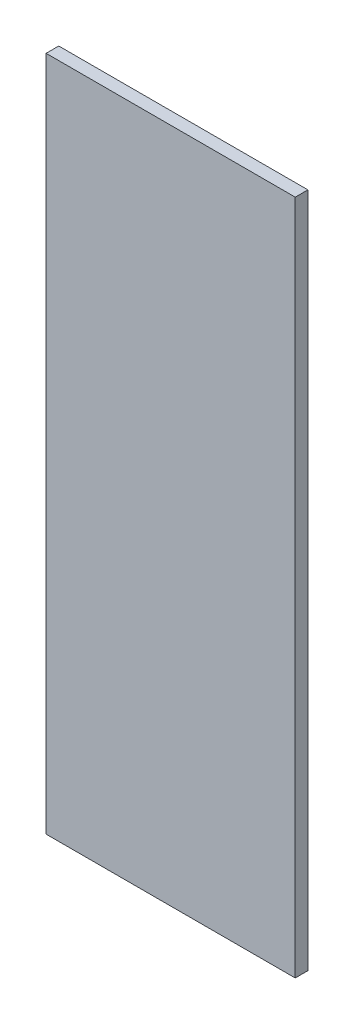
ISO-10303-21;
HEADER;
FILE_DESCRIPTION(('STEP AP214'),'2;1');
FILE_NAME('part.step','',(''),(''),'','','');
FILE_SCHEMA(('AUTOMOTIVE_DESIGN { 1 0 10303 214 1 1 1 1 }'));
ENDSEC;
DATA;
#1=APPLICATION_CONTEXT('core data for automotive mechanical design processes');
#2=APPLICATION_PROTOCOL_DEFINITION('international standard','automotive_design',2000,#1);
#3=PRODUCT_CONTEXT('',#1,'mechanical');
#4=PRODUCT('Part','Part','',(#3));
#5=PRODUCT_RELATED_PRODUCT_CATEGORY('part','',(#4));
#6=PRODUCT_DEFINITION_FORMATION('','',#4);
#7=PRODUCT_DEFINITION_CONTEXT('part definition',#1,'design');
#8=PRODUCT_DEFINITION('design','',#6,#7);
#9=PRODUCT_DEFINITION_SHAPE('','',#8);
#10=(LENGTH_UNIT() NAMED_UNIT(*) SI_UNIT(.MILLI.,.METRE.));
#11=(NAMED_UNIT(*) PLANE_ANGLE_UNIT() SI_UNIT($,.RADIAN.));
#12=(NAMED_UNIT(*) SI_UNIT($,.STERADIAN.) SOLID_ANGLE_UNIT());
#13=UNCERTAINTY_MEASURE_WITH_UNIT(LENGTH_MEASURE(1.E-05),#10,'distance_accuracy_value','');
#14=(GEOMETRIC_REPRESENTATION_CONTEXT(3) GLOBAL_UNCERTAINTY_ASSIGNED_CONTEXT((#13)) GLOBAL_UNIT_ASSIGNED_CONTEXT((#10,
#11,#12)) REPRESENTATION_CONTEXT('',''));
#15=CARTESIAN_POINT('',(0.,0.,0.));
#16=DIRECTION('',(0.,0.,1.));
#17=DIRECTION('',(1.,0.,0.));
#18=AXIS2_PLACEMENT_3D('',#15,#16,#17);
#19=CARTESIAN_POINT('',(92.9420013427735,76.5279998779297,0.));
#20=DIRECTION('',(1.,0.,0.));
#21=DIRECTION('',(0.,-1.,0.));
#22=AXIS2_PLACEMENT_3D('',#19,#20,#21);
#23=PLANE('',#22);
#24=DIRECTION('',(0.,-1.,0.));
#25=VECTOR('',#24,1.);
#26=CARTESIAN_POINT('',(92.9420013427734,76.5279998779297,0.03556));
#27=LINE('',#26,#25);
#28=CARTESIAN_POINT('',(92.9420013427734,76.5279998779297,0.03556));
#29=VERTEX_POINT('',#28);
#30=CARTESIAN_POINT('',(92.9420013427734,74.6279983520508,0.03556));
#31=VERTEX_POINT('',#30);
#32=EDGE_CURVE('E11',#29,#31,#27,.T.);
#33=ORIENTED_EDGE('',*,*,#32,.F.);
#34=DIRECTION('',(0.,0.,1.));
#35=VECTOR('',#34,1.);
#36=CARTESIAN_POINT('',(92.9420013427734,76.5279998779297,0.));
#37=LINE('',#36,#35);
#38=CARTESIAN_POINT('',(92.9420013427734,76.5279998779297,0.));
#39=VERTEX_POINT('',#38);
#40=EDGE_CURVE('E24',#39,#29,#37,.T.);
#41=ORIENTED_EDGE('',*,*,#40,.F.);
#42=DIRECTION('',(0.,-1.,0.));
#43=VECTOR('',#42,1.);
#44=CARTESIAN_POINT('',(92.9420013427734,76.5279998779297,0.));
#45=LINE('',#44,#43);
#46=CARTESIAN_POINT('',(92.9420013427734,74.6279983520508,0.));
#47=VERTEX_POINT('',#46);
#48=EDGE_CURVE('E75',#39,#47,#45,.T.);
#49=ORIENTED_EDGE('',*,*,#48,.T.);
#50=DIRECTION('',(0.,0.,1.));
#51=VECTOR('',#50,1.);
#52=CARTESIAN_POINT('',(92.9420013427734,74.6279983520508,0.));
#53=LINE('',#52,#51);
#54=EDGE_CURVE('E37',#47,#31,#53,.T.);
#55=ORIENTED_EDGE('',*,*,#54,.T.);
#56=EDGE_LOOP('',(#33,#41,#49,#55));
#57=FACE_BOUND('',#56,.T.);
#58=ADVANCED_FACE('F17',(#57),#23,.F.);
#59=CARTESIAN_POINT('',(92.9420013427735,74.6279983520508,0.));
#60=DIRECTION('',(0.,1.,0.));
#61=DIRECTION('',(1.,0.,0.));
#62=AXIS2_PLACEMENT_3D('',#59,#60,#61);
#63=PLANE('',#62);
#64=DIRECTION('',(1.,0.,0.));
#65=VECTOR('',#64,1.);
#66=CARTESIAN_POINT('',(92.9420013427734,74.6279983520508,0.03556));
#67=LINE('',#66,#65);
#68=CARTESIAN_POINT('',(93.6419982910156,74.6279983520508,0.03556));
#69=VERTEX_POINT('',#68);
#70=EDGE_CURVE('E83',#31,#69,#67,.T.);
#71=ORIENTED_EDGE('',*,*,#70,.F.);
#72=ORIENTED_EDGE('',*,*,#54,.F.);
#73=DIRECTION('',(1.,0.,0.));
#74=VECTOR('',#73,1.);
#75=CARTESIAN_POINT('',(92.9420013427734,74.6279983520508,0.));
#76=LINE('',#75,#74);
#77=CARTESIAN_POINT('',(93.6419982910156,74.6279983520508,0.));
#78=VERTEX_POINT('',#77);
#79=EDGE_CURVE('E81',#47,#78,#76,.T.);
#80=ORIENTED_EDGE('',*,*,#79,.T.);
#81=DIRECTION('',(0.,0.,1.));
#82=VECTOR('',#81,1.);
#83=CARTESIAN_POINT('',(93.6419982910156,74.6279983520508,0.));
#84=LINE('',#83,#82);
#85=EDGE_CURVE('E67',#78,#69,#84,.T.);
#86=ORIENTED_EDGE('',*,*,#85,.T.);
#87=EDGE_LOOP('',(#71,#72,#80,#86));
#88=FACE_BOUND('',#87,.T.);
#89=ADVANCED_FACE('F89',(#88),#63,.F.);
#90=CARTESIAN_POINT('',(93.6419982910156,74.6279983520508,0.));
#91=DIRECTION('',(-1.,0.,0.));
#92=DIRECTION('',(0.,1.,0.));
#93=AXIS2_PLACEMENT_3D('',#90,#91,#92);
#94=PLANE('',#93);
#95=DIRECTION('',(0.,1.,0.));
#96=VECTOR('',#95,1.);
#97=CARTESIAN_POINT('',(93.6419982910156,74.6279983520508,0.03556));
#98=LINE('',#97,#96);
#99=CARTESIAN_POINT('',(93.6419982910156,76.5279998779297,0.03556));
#100=VERTEX_POINT('',#99);
#101=EDGE_CURVE('E71',#69,#100,#98,.T.);
#102=ORIENTED_EDGE('',*,*,#101,.F.);
#103=ORIENTED_EDGE('',*,*,#85,.F.);
#104=DIRECTION('',(0.,1.,0.));
#105=VECTOR('',#104,1.);
#106=CARTESIAN_POINT('',(93.6419982910156,74.6279983520508,0.));
#107=LINE('',#106,#105);
#108=CARTESIAN_POINT('',(93.6419982910156,76.5279998779297,0.));
#109=VERTEX_POINT('',#108);
#110=EDGE_CURVE('E63',#78,#109,#107,.T.);
#111=ORIENTED_EDGE('',*,*,#110,.T.);
#112=DIRECTION('',(0.,0.,1.));
#113=VECTOR('',#112,1.);
#114=CARTESIAN_POINT('',(93.6419982910156,76.5279998779297,0.));
#115=LINE('',#114,#113);
#116=EDGE_CURVE('E53',#109,#100,#115,.T.);
#117=ORIENTED_EDGE('',*,*,#116,.T.);
#118=EDGE_LOOP('',(#102,#103,#111,#117));
#119=FACE_BOUND('',#118,.T.);
#120=ADVANCED_FACE('F66',(#119),#94,.F.);
#121=CARTESIAN_POINT('',(93.6419982910156,76.5279998779297,0.));
#122=DIRECTION('',(0.,-1.,0.));
#123=DIRECTION('',(-1.,0.,0.));
#124=AXIS2_PLACEMENT_3D('',#121,#122,#123);
#125=PLANE('',#124);
#126=DIRECTION('',(-1.,0.,0.));
#127=VECTOR('',#126,1.);
#128=CARTESIAN_POINT('',(93.6419982910156,76.5279998779297,0.03556));
#129=LINE('',#128,#127);
#130=EDGE_CURVE('E59',#100,#29,#129,.T.);
#131=ORIENTED_EDGE('',*,*,#130,.F.);
#132=ORIENTED_EDGE('',*,*,#116,.F.);
#133=DIRECTION('',(-1.,0.,0.));
#134=VECTOR('',#133,1.);
#135=CARTESIAN_POINT('',(93.6419982910156,76.5279998779297,0.));
#136=LINE('',#135,#134);
#137=EDGE_CURVE('E57',#109,#39,#136,.T.);
#138=ORIENTED_EDGE('',*,*,#137,.T.);
#139=ORIENTED_EDGE('',*,*,#40,.T.);
#140=EDGE_LOOP('',(#131,#132,#138,#139));
#141=FACE_BOUND('',#140,.T.);
#142=ADVANCED_FACE('F55',(#141),#125,.F.);
#143=CARTESIAN_POINT('',(92.9420013427735,76.5279998779297,0.));
#144=DIRECTION('',(0.,0.,-1.));
#145=DIRECTION('',(-1.,0.,0.));
#146=AXIS2_PLACEMENT_3D('',#143,#144,#145);
#147=PLANE('',#146);
#148=ORIENTED_EDGE('',*,*,#137,.F.);
#149=ORIENTED_EDGE('',*,*,#110,.F.);
#150=ORIENTED_EDGE('',*,*,#79,.F.);
#151=ORIENTED_EDGE('',*,*,#48,.F.);
#152=EDGE_LOOP('',(#148,#149,#150,#151));
#153=FACE_BOUND('',#152,.T.);
#154=ADVANCED_FACE('F74',(#153),#147,.T.);
#155=CARTESIAN_POINT('',(92.9420013427735,76.5279998779297,0.03556));
#156=DIRECTION('',(0.,0.,-1.));
#157=DIRECTION('',(-1.,0.,0.));
#158=AXIS2_PLACEMENT_3D('',#155,#156,#157);
#159=PLANE('',#158);
#160=ORIENTED_EDGE('',*,*,#32,.T.);
#161=ORIENTED_EDGE('',*,*,#70,.T.);
#162=ORIENTED_EDGE('',*,*,#101,.T.);
#163=ORIENTED_EDGE('',*,*,#130,.T.);
#164=EDGE_LOOP('',(#160,#161,#162,#163));
#165=FACE_BOUND('',#164,.T.);
#166=ADVANCED_FACE('F91',(#165),#159,.F.);
#167=CLOSED_SHELL('',(#58,#89,#120,#142,#154,#166));
#168=MANIFOLD_SOLID_BREP('B1',#167);
#169=ADVANCED_BREP_SHAPE_REPRESENTATION('',(#18,#168),#14);
#170=SHAPE_DEFINITION_REPRESENTATION(#9,#169);
ENDSEC;
END-ISO-10303-21;
